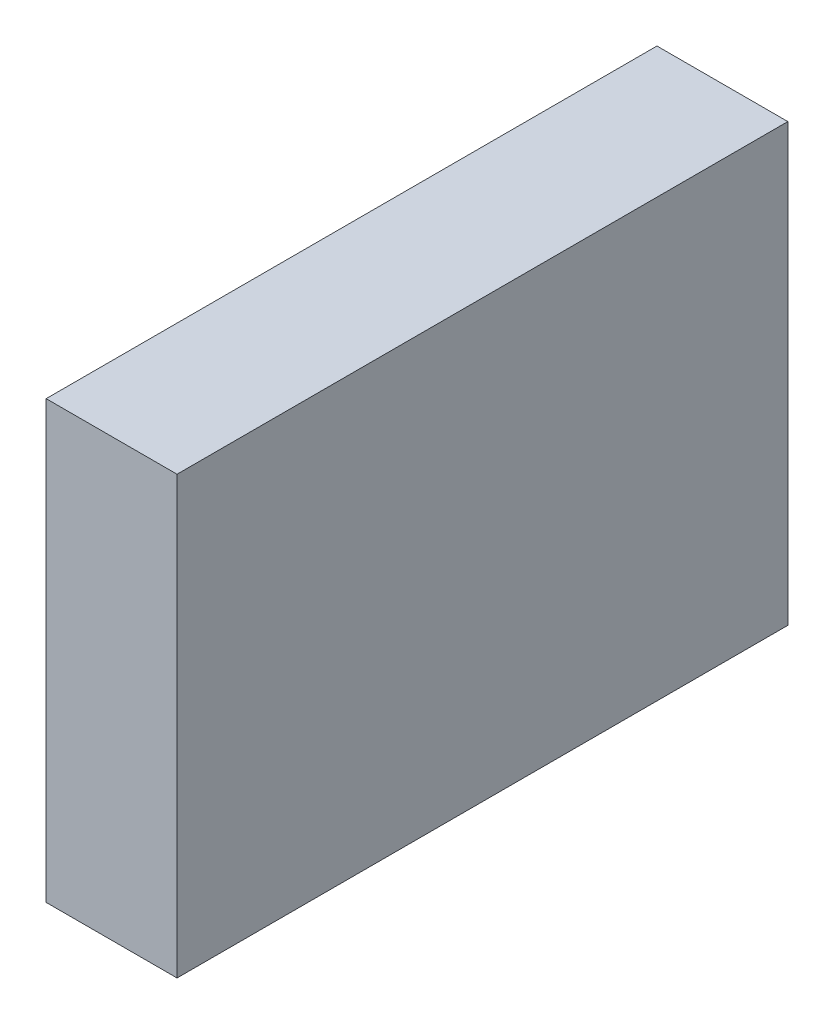
ISO-10303-21;
HEADER;
FILE_DESCRIPTION(('STEP AP214'),'2;1');
FILE_NAME('part.step','',(''),(''),'','','');
FILE_SCHEMA(('AUTOMOTIVE_DESIGN { 1 0 10303 214 1 1 1 1 }'));
ENDSEC;
DATA;
#1=APPLICATION_CONTEXT('core data for automotive mechanical design processes');
#2=APPLICATION_PROTOCOL_DEFINITION('international standard','automotive_design',2000,#1);
#3=PRODUCT_CONTEXT('',#1,'mechanical');
#4=PRODUCT('Part','Part','',(#3));
#5=PRODUCT_RELATED_PRODUCT_CATEGORY('part','',(#4));
#6=PRODUCT_DEFINITION_FORMATION('','',#4);
#7=PRODUCT_DEFINITION_CONTEXT('part definition',#1,'design');
#8=PRODUCT_DEFINITION('design','',#6,#7);
#9=PRODUCT_DEFINITION_SHAPE('','',#8);
#10=(LENGTH_UNIT() NAMED_UNIT(*) SI_UNIT(.MILLI.,.METRE.));
#11=(NAMED_UNIT(*) PLANE_ANGLE_UNIT() SI_UNIT($,.RADIAN.));
#12=(NAMED_UNIT(*) SI_UNIT($,.STERADIAN.) SOLID_ANGLE_UNIT());
#13=UNCERTAINTY_MEASURE_WITH_UNIT(LENGTH_MEASURE(1.E-05),#10,'distance_accuracy_value','');
#14=(GEOMETRIC_REPRESENTATION_CONTEXT(3) GLOBAL_UNCERTAINTY_ASSIGNED_CONTEXT((#13)) GLOBAL_UNIT_ASSIGNED_CONTEXT((#10,
#11,#12)) REPRESENTATION_CONTEXT('',''));
#15=CARTESIAN_POINT('',(0.,0.,0.));
#16=DIRECTION('',(0.,0.,1.));
#17=DIRECTION('',(1.,0.,0.));
#18=AXIS2_PLACEMENT_3D('',#15,#16,#17);
#19=CARTESIAN_POINT('',(-3.89999988110501,0.680000859364894,-3.72112158044361));
#20=DIRECTION('',(1.,-1.74845553146952E-07,0.));
#21=DIRECTION('',(1.74845553146952E-07,1.,-8.74227765734759E-08));
#22=AXIS2_PLACEMENT_3D('',#19,#20,#21);
#23=PLANE('',#22);
#24=DIRECTION('',(-1.74845553146599E-07,-0.999999999999981,8.74227761292101E-08));
#25=VECTOR('',#24,1.);
#26=CARTESIAN_POINT('',(-3.89999969402026,1.75000098787738,-2.25112167398598));
#27=LINE('',#26,#25);
#28=CARTESIAN_POINT('',(-3.89999969402026,1.75000098787638,-2.25112167398598));
#29=VERTEX_POINT('',#28);
#30=CARTESIAN_POINT('',(-3.89999986886581,0.750000987875375,-2.25112158656421));
#31=VERTEX_POINT('',#30);
#32=EDGE_CURVE('E11',#29,#31,#27,.T.);
#33=ORIENTED_EDGE('',*,*,#32,.T.);
#34=DIRECTION('',(0.,-8.74227765576152E-08,-0.999999999999996));
#35=VECTOR('',#34,1.);
#36=CARTESIAN_POINT('',(-3.89999986886581,0.750000987875375,-2.25112158656321));
#37=LINE('',#36,#35);
#38=CARTESIAN_POINT('',(-3.89999986886582,0.750000865484488,-3.65112158656321));
#39=VERTEX_POINT('',#38);
#40=EDGE_CURVE('E69',#31,#39,#37,.T.);
#41=ORIENTED_EDGE('',*,*,#40,.T.);
#42=DIRECTION('',(1.74845553146599E-07,0.999999999999981,-8.74227765732994E-08));
#43=VECTOR('',#42,1.);
#44=CARTESIAN_POINT('',(-3.89999986886582,0.750000865483488,-3.65112158656321));
#45=LINE('',#44,#43);
#46=CARTESIAN_POINT('',(-3.89999969402027,1.75000086548549,-3.65112167398498));
#47=VERTEX_POINT('',#46);
#48=EDGE_CURVE('E55',#39,#47,#45,.T.);
#49=ORIENTED_EDGE('',*,*,#48,.T.);
#50=DIRECTION('',(0.,8.74227764783136E-08,0.999999999999996));
#51=VECTOR('',#50,1.);
#52=CARTESIAN_POINT('',(-3.89999969402027,1.75000086548549,-3.65112167398598));
#53=LINE('',#52,#51);
#54=EDGE_CURVE('E53',#47,#29,#53,.T.);
#55=ORIENTED_EDGE('',*,*,#54,.T.);
#56=EDGE_LOOP('',(#33,#41,#49,#55));
#57=FACE_BOUND('',#56,.T.);
#58=ADVANCED_FACE('F17',(#57),#23,.T.);
#59=CARTESIAN_POINT('',(-4.19999988110501,0.68000091181856,-3.72112158044361));
#60=DIRECTION('',(1.,-1.74845553146952E-07,0.));
#61=DIRECTION('',(1.74845553146952E-07,1.,-8.74227765734759E-08));
#62=AXIS2_PLACEMENT_3D('',#59,#60,#61);
#63=PLANE('',#62);
#64=DIRECTION('',(0.,8.74227766369169E-08,0.999999999999996));
#65=VECTOR('',#64,1.);
#66=CARTESIAN_POINT('',(-4.19999969402027,1.75000091793915,-3.65112167398598));
#67=LINE('',#66,#65);
#68=CARTESIAN_POINT('',(-4.19999969402027,1.75000091793915,-3.65112167398498));
#69=VERTEX_POINT('',#68);
#70=CARTESIAN_POINT('',(-4.19999969402026,1.75000104033004,-2.25112167398598));
#71=VERTEX_POINT('',#70);
#72=EDGE_CURVE('E24',#69,#71,#67,.T.);
#73=ORIENTED_EDGE('',*,*,#72,.F.);
#74=DIRECTION('',(1.74845553146599E-07,0.999999999999981,-8.74227765732994E-08));
#75=VECTOR('',#74,1.);
#76=CARTESIAN_POINT('',(-4.19999986886582,0.750000917937154,-3.65112158656321));
#77=LINE('',#76,#75);
#78=CARTESIAN_POINT('',(-4.19999986886582,0.750000917938154,-3.65112158656321));
#79=VERTEX_POINT('',#78);
#80=EDGE_CURVE('E70',#79,#69,#77,.T.);
#81=ORIENTED_EDGE('',*,*,#80,.F.);
#82=DIRECTION('',(0.,-8.74227765576152E-08,-0.999999999999996));
#83=VECTOR('',#82,1.);
#84=CARTESIAN_POINT('',(-4.19999986886581,0.750001040329041,-2.25112158656321));
#85=LINE('',#84,#83);
#86=CARTESIAN_POINT('',(-4.19999986886581,0.750001040329041,-2.25112158656421));
#87=VERTEX_POINT('',#86);
#88=EDGE_CURVE('E59',#87,#79,#85,.T.);
#89=ORIENTED_EDGE('',*,*,#88,.F.);
#90=DIRECTION('',(-1.74845553146599E-07,-0.999999999999981,8.74227765732994E-08));
#91=VECTOR('',#90,1.);
#92=CARTESIAN_POINT('',(-4.19999969402026,1.75000104033104,-2.25112167398598));
#93=LINE('',#92,#91);
#94=EDGE_CURVE('E78',#71,#87,#93,.T.);
#95=ORIENTED_EDGE('',*,*,#94,.F.);
#96=EDGE_LOOP('',(#73,#81,#89,#95));
#97=FACE_BOUND('',#96,.T.);
#98=ADVANCED_FACE('F89',(#97),#63,.F.);
#99=CARTESIAN_POINT('',(-3.89999969402026,1.75000098787738,-2.25112167398598));
#100=DIRECTION('',(0.,-8.74227765734759E-08,-1.));
#101=DIRECTION('',(-1.74845553146952E-07,-1.,8.74227765734759E-08));
#102=AXIS2_PLACEMENT_3D('',#99,#100,#101);
#103=PLANE('',#102);
#104=DIRECTION('',(-0.999999999999985,1.74845552850889E-07,0.));
#105=VECTOR('',#104,1.);
#106=CARTESIAN_POINT('',(-3.89999969402025,1.75000098787737,-2.25112167398598));
#107=LINE('',#106,#105);
#108=EDGE_CURVE('E65',#29,#71,#107,.T.);
#109=ORIENTED_EDGE('',*,*,#108,.T.);
#110=ORIENTED_EDGE('',*,*,#94,.T.);
#111=DIRECTION('',(-0.999999999999985,1.74845553220963E-07,0.));
#112=VECTOR('',#111,1.);
#113=CARTESIAN_POINT('',(-3.89999986886581,0.750000987875375,-2.25112158656321));
#114=LINE('',#113,#112);
#115=EDGE_CURVE('E66',#31,#87,#114,.T.);
#116=ORIENTED_EDGE('',*,*,#115,.F.);
#117=ORIENTED_EDGE('',*,*,#32,.F.);
#118=EDGE_LOOP('',(#109,#110,#116,#117));
#119=FACE_BOUND('',#118,.T.);
#120=ADVANCED_FACE('F63',(#119),#103,.F.);
#121=CARTESIAN_POINT('',(-3.89999986886581,0.750000987875375,-2.25112158656321));
#122=DIRECTION('',(1.74845553146952E-07,1.,-8.74227765734759E-08));
#123=DIRECTION('',(0.,-8.74227765734759E-08,-1.));
#124=AXIS2_PLACEMENT_3D('',#121,#122,#123);
#125=PLANE('',#124);
#126=ORIENTED_EDGE('',*,*,#115,.T.);
#127=ORIENTED_EDGE('',*,*,#88,.T.);
#128=DIRECTION('',(-0.999999999999985,1.74845553220963E-07,0.));
#129=VECTOR('',#128,1.);
#130=CARTESIAN_POINT('',(-3.89999986886582,0.750000865483488,-3.65112158656321));
#131=LINE('',#130,#129);
#132=EDGE_CURVE('E60',#39,#79,#131,.T.);
#133=ORIENTED_EDGE('',*,*,#132,.F.);
#134=ORIENTED_EDGE('',*,*,#40,.F.);
#135=EDGE_LOOP('',(#126,#127,#133,#134));
#136=FACE_BOUND('',#135,.T.);
#137=ADVANCED_FACE('F91',(#136),#125,.F.);
#138=CARTESIAN_POINT('',(-3.89999986886582,0.750000865483488,-3.65112158656321));
#139=DIRECTION('',(0.,8.74227765734759E-08,1.));
#140=DIRECTION('',(1.74845553146952E-07,1.,-8.74227765734759E-08));
#141=AXIS2_PLACEMENT_3D('',#138,#139,#140);
#142=PLANE('',#141);
#143=ORIENTED_EDGE('',*,*,#132,.T.);
#144=ORIENTED_EDGE('',*,*,#80,.T.);
#145=DIRECTION('',(-0.999999999999985,1.74845552850889E-07,0.));
#146=VECTOR('',#145,1.);
#147=CARTESIAN_POINT('',(-3.89999969402027,1.75000086548549,-3.65112167398598));
#148=LINE('',#147,#146);
#149=EDGE_CURVE('E84',#47,#69,#148,.T.);
#150=ORIENTED_EDGE('',*,*,#149,.F.);
#151=ORIENTED_EDGE('',*,*,#48,.F.);
#152=EDGE_LOOP('',(#143,#144,#150,#151));
#153=FACE_BOUND('',#152,.T.);
#154=ADVANCED_FACE('F86',(#153),#142,.F.);
#155=CARTESIAN_POINT('',(-3.89999969402027,1.75000086548549,-3.65112167398598));
#156=DIRECTION('',(-1.74845553146952E-07,-1.,8.74227765734759E-08));
#157=DIRECTION('',(0.,8.74227765734759E-08,1.));
#158=AXIS2_PLACEMENT_3D('',#155,#156,#157);
#159=PLANE('',#158);
#160=ORIENTED_EDGE('',*,*,#149,.T.);
#161=ORIENTED_EDGE('',*,*,#72,.T.);
#162=ORIENTED_EDGE('',*,*,#108,.F.);
#163=ORIENTED_EDGE('',*,*,#54,.F.);
#164=EDGE_LOOP('',(#160,#161,#162,#163));
#165=FACE_BOUND('',#164,.T.);
#166=ADVANCED_FACE('F68',(#165),#159,.F.);
#167=CLOSED_SHELL('',(#58,#98,#120,#137,#154,#166));
#168=MANIFOLD_SOLID_BREP('B1',#167);
#169=ADVANCED_BREP_SHAPE_REPRESENTATION('',(#18,#168),#14);
#170=SHAPE_DEFINITION_REPRESENTATION(#9,#169);
ENDSEC;
END-ISO-10303-21;
